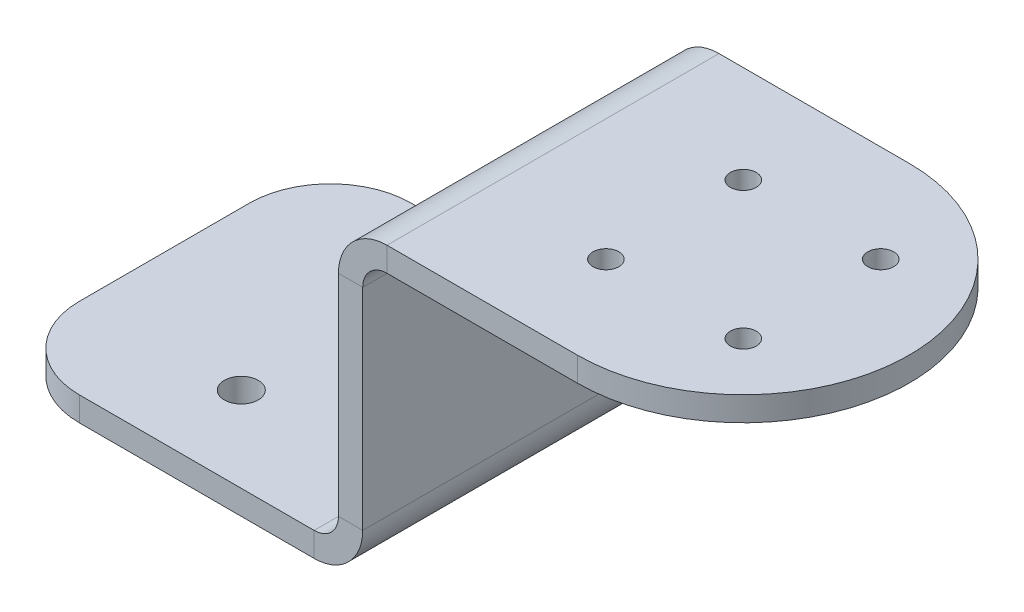
ISO-10303-21;
HEADER;
FILE_DESCRIPTION(('STEP AP214'),'2;1');
FILE_NAME('part.step','',(''),(''),'','','');
FILE_SCHEMA(('AUTOMOTIVE_DESIGN { 1 0 10303 214 1 1 1 1 }'));
ENDSEC;
DATA;
#1=APPLICATION_CONTEXT('core data for automotive mechanical design processes');
#2=APPLICATION_PROTOCOL_DEFINITION('international standard','automotive_design',2000,#1);
#3=PRODUCT_CONTEXT('',#1,'mechanical');
#4=PRODUCT('Part','Part','',(#3));
#5=PRODUCT_RELATED_PRODUCT_CATEGORY('part','',(#4));
#6=PRODUCT_DEFINITION_FORMATION('','',#4);
#7=PRODUCT_DEFINITION_CONTEXT('part definition',#1,'design');
#8=PRODUCT_DEFINITION('design','',#6,#7);
#9=PRODUCT_DEFINITION_SHAPE('','',#8);
#10=(LENGTH_UNIT() NAMED_UNIT(*) SI_UNIT(.MILLI.,.METRE.));
#11=(NAMED_UNIT(*) PLANE_ANGLE_UNIT() SI_UNIT($,.RADIAN.));
#12=(NAMED_UNIT(*) SI_UNIT($,.STERADIAN.) SOLID_ANGLE_UNIT());
#13=UNCERTAINTY_MEASURE_WITH_UNIT(LENGTH_MEASURE(1.E-05),#10,'distance_accuracy_value','');
#14=(GEOMETRIC_REPRESENTATION_CONTEXT(3) GLOBAL_UNCERTAINTY_ASSIGNED_CONTEXT((#13)) GLOBAL_UNIT_ASSIGNED_CONTEXT((#10,
#11,#12)) REPRESENTATION_CONTEXT('',''));
#15=CARTESIAN_POINT('',(0.,0.,0.));
#16=DIRECTION('',(0.,0.,1.));
#17=DIRECTION('',(1.,0.,0.));
#18=AXIS2_PLACEMENT_3D('',#15,#16,#17);
#19=CARTESIAN_POINT('',(0.,38.,41.));
#20=DIRECTION('',(0.,0.,1.));
#21=DIRECTION('',(1.,0.,0.));
#22=AXIS2_PLACEMENT_3D('',#19,#20,#21);
#23=PLANE('',#22);
#24=DIRECTION('',(1.,0.,0.));
#25=VECTOR('',#24,1.);
#26=CARTESIAN_POINT('',(0.,35.,41.));
#27=LINE('',#26,#25);
#28=CARTESIAN_POINT('',(3.,35.,41.));
#29=VERTEX_POINT('',#28);
#30=CARTESIAN_POINT('',(26.5,35.,41.));
#31=VERTEX_POINT('',#30);
#32=EDGE_CURVE('E171',#29,#31,#27,.T.);
#33=ORIENTED_EDGE('',*,*,#32,.T.);
#34=DIRECTION('',(0.,-1.,0.));
#35=VECTOR('',#34,1.);
#36=CARTESIAN_POINT('',(26.5,35.,41.));
#37=LINE('',#36,#35);
#38=CARTESIAN_POINT('',(26.5,38.,41.));
#39=VERTEX_POINT('',#38);
#40=EDGE_CURVE('E154',#31,#39,#37,.F.);
#41=ORIENTED_EDGE('',*,*,#40,.T.);
#42=DIRECTION('',(1.,0.,0.));
#43=VECTOR('',#42,1.);
#44=CARTESIAN_POINT('',(0.,38.,41.));
#45=LINE('',#44,#43);
#46=CARTESIAN_POINT('',(3.,38.,41.));
#47=VERTEX_POINT('',#46);
#48=EDGE_CURVE('E168',#47,#39,#45,.T.);
#49=ORIENTED_EDGE('',*,*,#48,.F.);
#50=DIRECTION('',(0.,1.,0.));
#51=VECTOR('',#50,1.);
#52=CARTESIAN_POINT('',(3.,38.,41.));
#53=LINE('',#52,#51);
#54=EDGE_CURVE('E295',#29,#47,#53,.T.);
#55=ORIENTED_EDGE('',*,*,#54,.F.);
#56=EDGE_LOOP('',(#33,#41,#49,#55));
#57=FACE_BOUND('',#56,.T.);
#58=ADVANCED_FACE('F49',(#57),#23,.T.);
#59=CARTESIAN_POINT('',(0.,38.,0.));
#60=DIRECTION('',(0.,0.,1.));
#61=DIRECTION('',(1.,0.,0.));
#62=AXIS2_PLACEMENT_3D('',#59,#60,#61);
#63=PLANE('',#62);
#64=DIRECTION('',(1.,0.,0.));
#65=VECTOR('',#64,1.);
#66=CARTESIAN_POINT('',(0.,38.,0.));
#67=LINE('',#66,#65);
#68=CARTESIAN_POINT('',(3.,38.,0.));
#69=VERTEX_POINT('',#68);
#70=CARTESIAN_POINT('',(26.5,38.,0.));
#71=VERTEX_POINT('',#70);
#72=EDGE_CURVE('E180',#69,#71,#67,.T.);
#73=ORIENTED_EDGE('',*,*,#72,.T.);
#74=DIRECTION('',(0.,-1.,0.));
#75=VECTOR('',#74,1.);
#76=CARTESIAN_POINT('',(26.5,35.,0.));
#77=LINE('',#76,#75);
#78=CARTESIAN_POINT('',(26.5,35.,0.));
#79=VERTEX_POINT('',#78);
#80=EDGE_CURVE('E157',#79,#71,#77,.F.);
#81=ORIENTED_EDGE('',*,*,#80,.F.);
#82=DIRECTION('',(1.,0.,0.));
#83=VECTOR('',#82,1.);
#84=CARTESIAN_POINT('',(0.,35.,0.));
#85=LINE('',#84,#83);
#86=CARTESIAN_POINT('',(3.,35.,0.));
#87=VERTEX_POINT('',#86);
#88=EDGE_CURVE('E267',#87,#79,#85,.T.);
#89=ORIENTED_EDGE('',*,*,#88,.F.);
#90=DIRECTION('',(0.,1.,0.));
#91=VECTOR('',#90,1.);
#92=CARTESIAN_POINT('',(3.,38.,0.));
#93=LINE('',#92,#91);
#94=EDGE_CURVE('E292',#87,#69,#93,.T.);
#95=ORIENTED_EDGE('',*,*,#94,.T.);
#96=EDGE_LOOP('',(#73,#81,#89,#95));
#97=FACE_BOUND('',#96,.T.);
#98=ADVANCED_FACE('F383',(#97),#63,.F.);
#99=CARTESIAN_POINT('',(0.,38.,41.));
#100=DIRECTION('',(0.,1.,0.));
#101=DIRECTION('',(0.,0.,1.));
#102=AXIS2_PLACEMENT_3D('',#99,#100,#101);
#103=PLANE('',#102);
#104=CARTESIAN_POINT('',(18.0147186257615,38.,12.0147186257614));
#105=DIRECTION('',(0.,1.,0.));
#106=DIRECTION('',(0.,0.,1.));
#107=AXIS2_PLACEMENT_3D('',#104,#105,#106);
#108=CIRCLE('',#107,1.6);
#109=CARTESIAN_POINT('',(18.0147186257615,38.,13.6147186257614));
#110=VERTEX_POINT('',#109);
#111=EDGE_CURVE('E403',#110,#110,#108,.F.);
#112=ORIENTED_EDGE('',*,*,#111,.T.);
#113=EDGE_LOOP('',(#112));
#114=FACE_BOUND('',#113,.T.);
#115=CARTESIAN_POINT('',(18.0147186257614,38.,28.9852813742386));
#116=DIRECTION('',(0.,1.,0.));
#117=DIRECTION('',(0.,0.,1.));
#118=AXIS2_PLACEMENT_3D('',#115,#116,#117);
#119=CIRCLE('',#118,1.6);
#120=CARTESIAN_POINT('',(18.0147186257614,38.,30.5852813742386));
#121=VERTEX_POINT('',#120);
#122=EDGE_CURVE('E426',#121,#121,#119,.F.);
#123=ORIENTED_EDGE('',*,*,#122,.T.);
#124=EDGE_LOOP('',(#123));
#125=FACE_BOUND('',#124,.T.);
#126=CARTESIAN_POINT('',(34.9852813742386,38.,28.9852813742386));
#127=DIRECTION('',(0.,1.,0.));
#128=DIRECTION('',(0.,0.,1.));
#129=AXIS2_PLACEMENT_3D('',#126,#127,#128);
#130=CIRCLE('',#129,1.59999999999997);
#131=CARTESIAN_POINT('',(34.9852813742386,38.,30.5852813742385));
#132=VERTEX_POINT('',#131);
#133=EDGE_CURVE('E418',#132,#132,#130,.F.);
#134=ORIENTED_EDGE('',*,*,#133,.T.);
#135=EDGE_LOOP('',(#134));
#136=FACE_BOUND('',#135,.T.);
#137=CARTESIAN_POINT('',(34.9852813742385,38.,12.0147186257614));
#138=DIRECTION('',(0.,1.,0.));
#139=DIRECTION('',(0.,0.,1.));
#140=AXIS2_PLACEMENT_3D('',#137,#138,#139);
#141=CIRCLE('',#140,1.60000000000003);
#142=CARTESIAN_POINT('',(34.9852813742385,38.,13.6147186257614));
#143=VERTEX_POINT('',#142);
#144=EDGE_CURVE('E409',#143,#143,#141,.F.);
#145=ORIENTED_EDGE('',*,*,#144,.T.);
#146=EDGE_LOOP('',(#145));
#147=FACE_BOUND('',#146,.T.);
#148=ORIENTED_EDGE('',*,*,#48,.T.);
#149=CARTESIAN_POINT('',(26.5,38.,20.5));
#150=DIRECTION('',(0.,1.,0.));
#151=DIRECTION('',(0.,0.,1.));
#152=AXIS2_PLACEMENT_3D('',#149,#150,#151);
#153=CIRCLE('',#152,20.5);
#154=EDGE_CURVE('E151',#39,#71,#153,.T.);
#155=ORIENTED_EDGE('',*,*,#154,.T.);
#156=ORIENTED_EDGE('',*,*,#72,.F.);
#157=DIRECTION('',(0.,0.,-1.));
#158=VECTOR('',#157,1.);
#159=CARTESIAN_POINT('',(3.,38.,41.));
#160=LINE('',#159,#158);
#161=EDGE_CURVE('E177',#69,#47,#160,.F.);
#162=ORIENTED_EDGE('',*,*,#161,.T.);
#163=EDGE_LOOP('',(#148,#155,#156,#162));
#164=FACE_BOUND('',#163,.T.);
#165=ADVANCED_FACE('F175',(#114,#125,#136,#147,#164),#103,.T.);
#166=CARTESIAN_POINT('',(0.,35.,41.));
#167=DIRECTION('',(0.,1.,0.));
#168=DIRECTION('',(0.,0.,1.));
#169=AXIS2_PLACEMENT_3D('',#166,#167,#168);
#170=PLANE('',#169);
#171=CARTESIAN_POINT('',(18.0147186257615,35.,12.0147186257614));
#172=DIRECTION('',(0.,1.,0.));
#173=DIRECTION('',(0.,0.,1.));
#174=AXIS2_PLACEMENT_3D('',#171,#172,#173);
#175=CIRCLE('',#174,1.6);
#176=CARTESIAN_POINT('',(18.0147186257615,35.,13.6147186257614));
#177=VERTEX_POINT('',#176);
#178=EDGE_CURVE('E430',#177,#177,#175,.F.);
#179=ORIENTED_EDGE('',*,*,#178,.F.);
#180=EDGE_LOOP('',(#179));
#181=FACE_BOUND('',#180,.T.);
#182=CARTESIAN_POINT('',(18.0147186257614,35.,28.9852813742386));
#183=DIRECTION('',(0.,1.,0.));
#184=DIRECTION('',(0.,0.,1.));
#185=AXIS2_PLACEMENT_3D('',#182,#183,#184);
#186=CIRCLE('',#185,1.6);
#187=CARTESIAN_POINT('',(18.0147186257614,35.,30.5852813742386));
#188=VERTEX_POINT('',#187);
#189=EDGE_CURVE('E422',#188,#188,#186,.F.);
#190=ORIENTED_EDGE('',*,*,#189,.F.);
#191=EDGE_LOOP('',(#190));
#192=FACE_BOUND('',#191,.T.);
#193=CARTESIAN_POINT('',(34.9852813742386,35.,28.9852813742386));
#194=DIRECTION('',(0.,1.,0.));
#195=DIRECTION('',(0.,0.,1.));
#196=AXIS2_PLACEMENT_3D('',#193,#194,#195);
#197=CIRCLE('',#196,1.59999999999997);
#198=CARTESIAN_POINT('',(34.9852813742386,35.,30.5852813742385));
#199=VERTEX_POINT('',#198);
#200=EDGE_CURVE('E414',#199,#199,#197,.F.);
#201=ORIENTED_EDGE('',*,*,#200,.F.);
#202=EDGE_LOOP('',(#201));
#203=FACE_BOUND('',#202,.T.);
#204=CARTESIAN_POINT('',(34.9852813742385,35.,12.0147186257614));
#205=DIRECTION('',(0.,1.,0.));
#206=DIRECTION('',(0.,0.,1.));
#207=AXIS2_PLACEMENT_3D('',#204,#205,#206);
#208=CIRCLE('',#207,1.60000000000003);
#209=CARTESIAN_POINT('',(34.9852813742385,35.,13.6147186257614));
#210=VERTEX_POINT('',#209);
#211=EDGE_CURVE('E405',#210,#210,#208,.F.);
#212=ORIENTED_EDGE('',*,*,#211,.F.);
#213=EDGE_LOOP('',(#212));
#214=FACE_BOUND('',#213,.T.);
#215=CARTESIAN_POINT('',(26.5,35.,20.5));
#216=DIRECTION('',(0.,1.,0.));
#217=DIRECTION('',(0.,0.,1.));
#218=AXIS2_PLACEMENT_3D('',#215,#216,#217);
#219=CIRCLE('',#218,20.5);
#220=EDGE_CURVE('E163',#31,#79,#219,.T.);
#221=ORIENTED_EDGE('',*,*,#220,.F.);
#222=ORIENTED_EDGE('',*,*,#32,.F.);
#223=DIRECTION('',(0.,0.,1.));
#224=VECTOR('',#223,1.);
#225=CARTESIAN_POINT('',(3.,35.,41.));
#226=LINE('',#225,#224);
#227=EDGE_CURVE('E233',#87,#29,#226,.T.);
#228=ORIENTED_EDGE('',*,*,#227,.F.);
#229=ORIENTED_EDGE('',*,*,#88,.T.);
#230=EDGE_LOOP('',(#221,#222,#228,#229));
#231=FACE_BOUND('',#230,.T.);
#232=ADVANCED_FACE('F385',(#181,#192,#203,#214,#231),#170,.F.);
#233=CARTESIAN_POINT('',(-3.,0.,41.));
#234=DIRECTION('',(0.,0.,1.));
#235=DIRECTION('',(0.,1.,0.));
#236=AXIS2_PLACEMENT_3D('',#233,#234,#235);
#237=PLANE('',#236);
#238=DIRECTION('',(-1.,0.,0.));
#239=VECTOR('',#238,1.);
#240=CARTESIAN_POINT('',(-3.,6.,41.));
#241=LINE('',#240,#239);
#242=CARTESIAN_POINT('',(0.,6.,41.));
#243=VERTEX_POINT('',#242);
#244=CARTESIAN_POINT('',(-3.,6.,41.));
#245=VERTEX_POINT('',#244);
#246=EDGE_CURVE('E301',#243,#245,#241,.T.);
#247=ORIENTED_EDGE('',*,*,#246,.F.);
#248=DIRECTION('',(0.,1.,0.));
#249=VECTOR('',#248,1.);
#250=CARTESIAN_POINT('',(0.,0.,41.));
#251=LINE('',#250,#249);
#252=CARTESIAN_POINT('',(0.,32.,41.));
#253=VERTEX_POINT('',#252);
#254=EDGE_CURVE('E261',#243,#253,#251,.T.);
#255=ORIENTED_EDGE('',*,*,#254,.T.);
#256=DIRECTION('',(-1.,0.,0.));
#257=VECTOR('',#256,1.);
#258=CARTESIAN_POINT('',(-3.,32.,41.));
#259=LINE('',#258,#257);
#260=CARTESIAN_POINT('',(-3.,32.,41.));
#261=VERTEX_POINT('',#260);
#262=EDGE_CURVE('E298',#253,#261,#259,.T.);
#263=ORIENTED_EDGE('',*,*,#262,.T.);
#264=DIRECTION('',(0.,1.,0.));
#265=VECTOR('',#264,1.);
#266=CARTESIAN_POINT('',(-3.,0.,41.));
#267=LINE('',#266,#265);
#268=EDGE_CURVE('E187',#245,#261,#267,.T.);
#269=ORIENTED_EDGE('',*,*,#268,.F.);
#270=EDGE_LOOP('',(#247,#255,#263,#269));
#271=FACE_BOUND('',#270,.T.);
#272=ADVANCED_FACE('F390',(#271),#237,.T.);
#273=CARTESIAN_POINT('',(3.,32.,41.));
#274=DIRECTION('',(0.,0.,-1.));
#275=DIRECTION('',(-1.,0.,0.));
#276=AXIS2_PLACEMENT_3D('',#273,#274,#275);
#277=PLANE('',#276);
#278=ORIENTED_EDGE('',*,*,#262,.F.);
#279=CARTESIAN_POINT('',(3.,32.,41.));
#280=DIRECTION('',(0.,0.,-1.));
#281=DIRECTION('',(-1.,0.,0.));
#282=AXIS2_PLACEMENT_3D('',#279,#280,#281);
#283=CIRCLE('',#282,3.);
#284=EDGE_CURVE('E262',#253,#29,#283,.T.);
#285=ORIENTED_EDGE('',*,*,#284,.T.);
#286=ORIENTED_EDGE('',*,*,#54,.T.);
#287=CARTESIAN_POINT('',(3.,32.,41.));
#288=DIRECTION('',(0.,0.,1.));
#289=DIRECTION('',(1.,0.,0.));
#290=AXIS2_PLACEMENT_3D('',#287,#288,#289);
#291=CIRCLE('',#290,6.);
#292=EDGE_CURVE('E207',#261,#47,#291,.F.);
#293=ORIENTED_EDGE('',*,*,#292,.F.);
#294=EDGE_LOOP('',(#278,#285,#286,#293));
#295=FACE_BOUND('',#294,.T.);
#296=ADVANCED_FACE('F387',(#295),#277,.F.);
#297=CARTESIAN_POINT('',(3.,32.,0.));
#298=DIRECTION('',(0.,0.,1.));
#299=DIRECTION('',(1.,0.,0.));
#300=AXIS2_PLACEMENT_3D('',#297,#298,#299);
#301=PLANE('',#300);
#302=ORIENTED_EDGE('',*,*,#94,.F.);
#303=CARTESIAN_POINT('',(3.,32.,0.));
#304=DIRECTION('',(0.,0.,-1.));
#305=DIRECTION('',(-1.,0.,0.));
#306=AXIS2_PLACEMENT_3D('',#303,#304,#305);
#307=CIRCLE('',#306,3.);
#308=CARTESIAN_POINT('',(0.,32.,0.));
#309=VERTEX_POINT('',#308);
#310=EDGE_CURVE('E263',#87,#309,#307,.F.);
#311=ORIENTED_EDGE('',*,*,#310,.T.);
#312=DIRECTION('',(-1.,0.,0.));
#313=VECTOR('',#312,1.);
#314=CARTESIAN_POINT('',(-3.,32.,0.));
#315=LINE('',#314,#313);
#316=CARTESIAN_POINT('',(-3.,32.,0.));
#317=VERTEX_POINT('',#316);
#318=EDGE_CURVE('E289',#309,#317,#315,.T.);
#319=ORIENTED_EDGE('',*,*,#318,.T.);
#320=CARTESIAN_POINT('',(3.,32.,0.));
#321=DIRECTION('',(0.,0.,-1.));
#322=DIRECTION('',(-1.,0.,0.));
#323=AXIS2_PLACEMENT_3D('',#320,#321,#322);
#324=CIRCLE('',#323,6.);
#325=EDGE_CURVE('E203',#69,#317,#324,.F.);
#326=ORIENTED_EDGE('',*,*,#325,.F.);
#327=EDGE_LOOP('',(#302,#311,#319,#326));
#328=FACE_BOUND('',#327,.T.);
#329=ADVANCED_FACE('F376',(#328),#301,.F.);
#330=CARTESIAN_POINT('',(-3.,0.,0.));
#331=DIRECTION('',(0.,0.,1.));
#332=DIRECTION('',(0.,1.,0.));
#333=AXIS2_PLACEMENT_3D('',#330,#331,#332);
#334=PLANE('',#333);
#335=ORIENTED_EDGE('',*,*,#318,.F.);
#336=DIRECTION('',(0.,1.,0.));
#337=VECTOR('',#336,1.);
#338=CARTESIAN_POINT('',(0.,0.,0.));
#339=LINE('',#338,#337);
#340=CARTESIAN_POINT('',(0.,6.,0.));
#341=VERTEX_POINT('',#340);
#342=EDGE_CURVE('E257',#341,#309,#339,.T.);
#343=ORIENTED_EDGE('',*,*,#342,.F.);
#344=DIRECTION('',(-1.,0.,0.));
#345=VECTOR('',#344,1.);
#346=CARTESIAN_POINT('',(-3.,6.,0.));
#347=LINE('',#346,#345);
#348=CARTESIAN_POINT('',(-3.,6.,0.));
#349=VERTEX_POINT('',#348);
#350=EDGE_CURVE('E286',#341,#349,#347,.T.);
#351=ORIENTED_EDGE('',*,*,#350,.T.);
#352=DIRECTION('',(0.,1.,0.));
#353=VECTOR('',#352,1.);
#354=CARTESIAN_POINT('',(-3.,0.,0.));
#355=LINE('',#354,#353);
#356=EDGE_CURVE('E212',#349,#317,#355,.T.);
#357=ORIENTED_EDGE('',*,*,#356,.T.);
#358=EDGE_LOOP('',(#335,#343,#351,#357));
#359=FACE_BOUND('',#358,.T.);
#360=ADVANCED_FACE('F367',(#359),#334,.F.);
#361=CARTESIAN_POINT('',(-6.,6.,0.));
#362=DIRECTION('',(0.,0.,-1.));
#363=DIRECTION('',(-1.,0.,0.));
#364=AXIS2_PLACEMENT_3D('',#361,#362,#363);
#365=PLANE('',#364);
#366=ORIENTED_EDGE('',*,*,#350,.F.);
#367=CARTESIAN_POINT('',(-6.,6.,0.));
#368=DIRECTION('',(0.,0.,1.));
#369=DIRECTION('',(1.,0.,0.));
#370=AXIS2_PLACEMENT_3D('',#367,#368,#369);
#371=CIRCLE('',#370,6.);
#372=CARTESIAN_POINT('',(-6.,0.,0.));
#373=VERTEX_POINT('',#372);
#374=EDGE_CURVE('E173',#341,#373,#371,.F.);
#375=ORIENTED_EDGE('',*,*,#374,.T.);
#376=DIRECTION('',(0.,1.,0.));
#377=VECTOR('',#376,1.);
#378=CARTESIAN_POINT('',(-6.,3.,0.));
#379=LINE('',#378,#377);
#380=CARTESIAN_POINT('',(-6.,3.,0.));
#381=VERTEX_POINT('',#380);
#382=EDGE_CURVE('E282',#373,#381,#379,.T.);
#383=ORIENTED_EDGE('',*,*,#382,.T.);
#384=CARTESIAN_POINT('',(-6.,6.,0.));
#385=DIRECTION('',(0.,0.,1.));
#386=DIRECTION('',(1.,0.,0.));
#387=AXIS2_PLACEMENT_3D('',#384,#385,#386);
#388=CIRCLE('',#387,3.);
#389=EDGE_CURVE('E221',#349,#381,#388,.F.);
#390=ORIENTED_EDGE('',*,*,#389,.F.);
#391=EDGE_LOOP('',(#366,#375,#383,#390));
#392=FACE_BOUND('',#391,.T.);
#393=ADVANCED_FACE('F358',(#392),#365,.T.);
#394=CARTESIAN_POINT('',(0.,3.,0.));
#395=DIRECTION('',(0.,0.,1.));
#396=DIRECTION('',(1.,0.,0.));
#397=AXIS2_PLACEMENT_3D('',#394,#395,#396);
#398=PLANE('',#397);
#399=DIRECTION('',(-1.,0.,0.));
#400=VECTOR('',#399,1.);
#401=CARTESIAN_POINT('',(0.,0.,0.));
#402=LINE('',#401,#400);
#403=CARTESIAN_POINT('',(-35.,0.,0.));
#404=VERTEX_POINT('',#403);
#405=EDGE_CURVE('E250',#404,#373,#402,.F.);
#406=ORIENTED_EDGE('',*,*,#405,.F.);
#407=DIRECTION('',(0.,-1.,0.));
#408=VECTOR('',#407,1.);
#409=CARTESIAN_POINT('',(-35.,3.,0.));
#410=LINE('',#409,#408);
#411=CARTESIAN_POINT('',(-35.,3.,0.));
#412=VERTEX_POINT('',#411);
#413=EDGE_CURVE('E304',#404,#412,#410,.F.);
#414=ORIENTED_EDGE('',*,*,#413,.T.);
#415=DIRECTION('',(1.,0.,0.));
#416=VECTOR('',#415,1.);
#417=CARTESIAN_POINT('',(0.,3.,0.));
#418=LINE('',#417,#416);
#419=EDGE_CURVE('E179',#412,#381,#418,.T.);
#420=ORIENTED_EDGE('',*,*,#419,.T.);
#421=ORIENTED_EDGE('',*,*,#382,.F.);
#422=EDGE_LOOP('',(#406,#414,#420,#421));
#423=FACE_BOUND('',#422,.T.);
#424=ADVANCED_FACE('F336',(#423),#398,.F.);
#425=CARTESIAN_POINT('',(-45.,2.99999999999999,41.));
#426=DIRECTION('',(1.,0.,0.));
#427=DIRECTION('',(0.,0.,-1.));
#428=AXIS2_PLACEMENT_3D('',#425,#426,#427);
#429=PLANE('',#428);
#430=DIRECTION('',(0.,0.,-1.));
#431=VECTOR('',#430,1.);
#432=CARTESIAN_POINT('',(-45.,2.99999999999999,41.));
#433=LINE('',#432,#431);
#434=CARTESIAN_POINT('',(-45.,2.99999999999999,31.));
#435=VERTEX_POINT('',#434);
#436=CARTESIAN_POINT('',(-45.,2.99999999999999,10.));
#437=VERTEX_POINT('',#436);
#438=EDGE_CURVE('E185',#435,#437,#433,.T.);
#439=ORIENTED_EDGE('',*,*,#438,.T.);
#440=DIRECTION('',(0.,-1.,0.));
#441=VECTOR('',#440,1.);
#442=CARTESIAN_POINT('',(-45.,2.99999999999999,10.));
#443=LINE('',#442,#441);
#444=CARTESIAN_POINT('',(-45.,0.,10.));
#445=VERTEX_POINT('',#444);
#446=EDGE_CURVE('E71',#437,#445,#443,.T.);
#447=ORIENTED_EDGE('',*,*,#446,.T.);
#448=DIRECTION('',(0.,0.,1.));
#449=VECTOR('',#448,1.);
#450=CARTESIAN_POINT('',(-45.,0.,41.));
#451=LINE('',#450,#449);
#452=CARTESIAN_POINT('',(-45.,0.,31.));
#453=VERTEX_POINT('',#452);
#454=EDGE_CURVE('E247',#453,#445,#451,.F.);
#455=ORIENTED_EDGE('',*,*,#454,.F.);
#456=DIRECTION('',(0.,1.,0.));
#457=VECTOR('',#456,1.);
#458=CARTESIAN_POINT('',(-45.,2.99999999999999,31.));
#459=LINE('',#458,#457);
#460=EDGE_CURVE('E317',#453,#435,#459,.T.);
#461=ORIENTED_EDGE('',*,*,#460,.T.);
#462=EDGE_LOOP('',(#439,#447,#455,#461));
#463=FACE_BOUND('',#462,.T.);
#464=ADVANCED_FACE('F342',(#463),#429,.F.);
#465=CARTESIAN_POINT('',(0.,3.,41.));
#466=DIRECTION('',(0.,0.,1.));
#467=DIRECTION('',(1.,0.,0.));
#468=AXIS2_PLACEMENT_3D('',#465,#466,#467);
#469=PLANE('',#468);
#470=DIRECTION('',(1.,0.,0.));
#471=VECTOR('',#470,1.);
#472=CARTESIAN_POINT('',(0.,3.,41.));
#473=LINE('',#472,#471);
#474=CARTESIAN_POINT('',(-35.,3.,41.));
#475=VERTEX_POINT('',#474);
#476=CARTESIAN_POINT('',(-6.,3.,41.));
#477=VERTEX_POINT('',#476);
#478=EDGE_CURVE('E193',#475,#477,#473,.T.);
#479=ORIENTED_EDGE('',*,*,#478,.F.);
#480=DIRECTION('',(0.,-1.,0.));
#481=VECTOR('',#480,1.);
#482=CARTESIAN_POINT('',(-35.,3.,41.));
#483=LINE('',#482,#481);
#484=CARTESIAN_POINT('',(-35.,0.,41.));
#485=VERTEX_POINT('',#484);
#486=EDGE_CURVE('E11',#475,#485,#483,.T.);
#487=ORIENTED_EDGE('',*,*,#486,.T.);
#488=DIRECTION('',(-1.,0.,0.));
#489=VECTOR('',#488,1.);
#490=CARTESIAN_POINT('',(0.,0.,41.));
#491=LINE('',#490,#489);
#492=CARTESIAN_POINT('',(-6.,0.,41.));
#493=VERTEX_POINT('',#492);
#494=EDGE_CURVE('E241',#485,#493,#491,.F.);
#495=ORIENTED_EDGE('',*,*,#494,.T.);
#496=DIRECTION('',(0.,1.,0.));
#497=VECTOR('',#496,1.);
#498=CARTESIAN_POINT('',(-6.,3.,41.));
#499=LINE('',#498,#497);
#500=EDGE_CURVE('E220',#493,#477,#499,.T.);
#501=ORIENTED_EDGE('',*,*,#500,.T.);
#502=EDGE_LOOP('',(#479,#487,#495,#501));
#503=FACE_BOUND('',#502,.T.);
#504=ADVANCED_FACE('F346',(#503),#469,.T.);
#505=CARTESIAN_POINT('',(-6.,6.,41.));
#506=DIRECTION('',(0.,0.,1.));
#507=DIRECTION('',(1.,0.,0.));
#508=AXIS2_PLACEMENT_3D('',#505,#506,#507);
#509=PLANE('',#508);
#510=CARTESIAN_POINT('',(-6.,6.,41.));
#511=DIRECTION('',(0.,0.,1.));
#512=DIRECTION('',(1.,0.,0.));
#513=AXIS2_PLACEMENT_3D('',#510,#511,#512);
#514=CIRCLE('',#513,6.);
#515=EDGE_CURVE('E256',#493,#243,#514,.T.);
#516=ORIENTED_EDGE('',*,*,#515,.T.);
#517=ORIENTED_EDGE('',*,*,#246,.T.);
#518=CARTESIAN_POINT('',(-6.,6.,41.));
#519=DIRECTION('',(0.,0.,-1.));
#520=DIRECTION('',(-1.,0.,0.));
#521=AXIS2_PLACEMENT_3D('',#518,#519,#520);
#522=CIRCLE('',#521,3.);
#523=EDGE_CURVE('E208',#477,#245,#522,.F.);
#524=ORIENTED_EDGE('',*,*,#523,.F.);
#525=ORIENTED_EDGE('',*,*,#500,.F.);
#526=EDGE_LOOP('',(#516,#517,#524,#525));
#527=FACE_BOUND('',#526,.T.);
#528=ADVANCED_FACE('F351',(#527),#509,.T.);
#529=CARTESIAN_POINT('',(0.,3.,41.));
#530=DIRECTION('',(0.,1.,0.));
#531=DIRECTION('',(-1.,0.,0.));
#532=AXIS2_PLACEMENT_3D('',#529,#530,#531);
#533=PLANE('',#532);
#534=CARTESIAN_POINT('',(-25.5,3.,10.5));
#535=DIRECTION('',(0.,1.,0.));
#536=DIRECTION('',(0.,0.,1.));
#537=AXIS2_PLACEMENT_3D('',#534,#535,#536);
#538=CIRCLE('',#537,2.09999999999999);
#539=CARTESIAN_POINT('',(-25.5,3.,12.6));
#540=VERTEX_POINT('',#539);
#541=EDGE_CURVE('E448',#540,#540,#538,.T.);
#542=ORIENTED_EDGE('',*,*,#541,.F.);
#543=EDGE_LOOP('',(#542));
#544=FACE_BOUND('',#543,.T.);
#545=CARTESIAN_POINT('',(-25.5,3.,30.5));
#546=DIRECTION('',(0.,1.,0.));
#547=DIRECTION('',(0.,0.,1.));
#548=AXIS2_PLACEMENT_3D('',#545,#546,#547);
#549=CIRCLE('',#548,2.09999999999999);
#550=CARTESIAN_POINT('',(-25.5,3.,32.6));
#551=VERTEX_POINT('',#550);
#552=EDGE_CURVE('E440',#551,#551,#549,.T.);
#553=ORIENTED_EDGE('',*,*,#552,.F.);
#554=EDGE_LOOP('',(#553));
#555=FACE_BOUND('',#554,.T.);
#556=ORIENTED_EDGE('',*,*,#419,.F.);
#557=CARTESIAN_POINT('',(-35.,3.,10.));
#558=DIRECTION('',(0.,1.,0.));
#559=DIRECTION('',(-1.,0.,0.));
#560=AXIS2_PLACEMENT_3D('',#557,#558,#559);
#561=CIRCLE('',#560,10.);
#562=EDGE_CURVE('E314',#412,#437,#561,.T.);
#563=ORIENTED_EDGE('',*,*,#562,.T.);
#564=ORIENTED_EDGE('',*,*,#438,.F.);
#565=CARTESIAN_POINT('',(-35.,3.,31.));
#566=DIRECTION('',(0.,1.,0.));
#567=DIRECTION('',(-1.,0.,0.));
#568=AXIS2_PLACEMENT_3D('',#565,#566,#567);
#569=CIRCLE('',#568,10.);
#570=EDGE_CURVE('E311',#435,#475,#569,.T.);
#571=ORIENTED_EDGE('',*,*,#570,.T.);
#572=ORIENTED_EDGE('',*,*,#478,.T.);
#573=DIRECTION('',(0.,0.,-1.));
#574=VECTOR('',#573,1.);
#575=CARTESIAN_POINT('',(-6.,3.,0.));
#576=LINE('',#575,#574);
#577=EDGE_CURVE('E202',#477,#381,#576,.T.);
#578=ORIENTED_EDGE('',*,*,#577,.T.);
#579=EDGE_LOOP('',(#556,#563,#564,#571,#572,#578));
#580=FACE_BOUND('',#579,.T.);
#581=ADVANCED_FACE('F341',(#544,#555,#580),#533,.T.);
#582=CARTESIAN_POINT('',(-3.,0.,41.));
#583=DIRECTION('',(-1.,0.,0.));
#584=DIRECTION('',(0.,0.,1.));
#585=AXIS2_PLACEMENT_3D('',#582,#583,#584);
#586=PLANE('',#585);
#587=ORIENTED_EDGE('',*,*,#356,.F.);
#588=DIRECTION('',(0.,0.,-1.));
#589=VECTOR('',#588,1.);
#590=CARTESIAN_POINT('',(-3.,6.,41.));
#591=LINE('',#590,#589);
#592=EDGE_CURVE('E216',#349,#245,#591,.F.);
#593=ORIENTED_EDGE('',*,*,#592,.T.);
#594=ORIENTED_EDGE('',*,*,#268,.T.);
#595=DIRECTION('',(0.,0.,-1.));
#596=VECTOR('',#595,1.);
#597=CARTESIAN_POINT('',(-3.,32.,41.));
#598=LINE('',#597,#596);
#599=EDGE_CURVE('E196',#261,#317,#598,.T.);
#600=ORIENTED_EDGE('',*,*,#599,.T.);
#601=EDGE_LOOP('',(#587,#593,#594,#600));
#602=FACE_BOUND('',#601,.T.);
#603=ADVANCED_FACE('F394',(#602),#586,.T.);
#604=CARTESIAN_POINT('',(3.,32.,41.));
#605=DIRECTION('',(0.,0.,-1.));
#606=DIRECTION('',(-1.,0.,0.));
#607=AXIS2_PLACEMENT_3D('',#604,#605,#606);
#608=CYLINDRICAL_SURFACE('',#607,6.);
#609=ORIENTED_EDGE('',*,*,#292,.T.);
#610=ORIENTED_EDGE('',*,*,#161,.F.);
#611=ORIENTED_EDGE('',*,*,#325,.T.);
#612=ORIENTED_EDGE('',*,*,#599,.F.);
#613=EDGE_LOOP('',(#609,#610,#611,#612));
#614=FACE_BOUND('',#613,.T.);
#615=ADVANCED_FACE('F598',(#614),#608,.T.);
#616=CARTESIAN_POINT('',(-6.,6.,41.));
#617=DIRECTION('',(0.,0.,1.));
#618=DIRECTION('',(1.,0.,0.));
#619=AXIS2_PLACEMENT_3D('',#616,#617,#618);
#620=CYLINDRICAL_SURFACE('',#619,3.);
#621=ORIENTED_EDGE('',*,*,#523,.T.);
#622=ORIENTED_EDGE('',*,*,#592,.F.);
#623=ORIENTED_EDGE('',*,*,#389,.T.);
#624=ORIENTED_EDGE('',*,*,#577,.F.);
#625=EDGE_LOOP('',(#621,#622,#623,#624));
#626=FACE_BOUND('',#625,.T.);
#627=ADVANCED_FACE('F355',(#626),#620,.F.);
#628=CARTESIAN_POINT('',(0.,0.,41.));
#629=DIRECTION('',(0.,1.,0.));
#630=DIRECTION('',(-1.,0.,0.));
#631=AXIS2_PLACEMENT_3D('',#628,#629,#630);
#632=PLANE('',#631);
#633=CARTESIAN_POINT('',(-25.5,0.,10.5));
#634=DIRECTION('',(0.,1.,0.));
#635=DIRECTION('',(0.,0.,1.));
#636=AXIS2_PLACEMENT_3D('',#633,#634,#635);
#637=CIRCLE('',#636,2.09999999999999);
#638=CARTESIAN_POINT('',(-25.5,0.,12.6));
#639=VERTEX_POINT('',#638);
#640=EDGE_CURVE('E444',#639,#639,#637,.T.);
#641=ORIENTED_EDGE('',*,*,#640,.T.);
#642=EDGE_LOOP('',(#641));
#643=FACE_BOUND('',#642,.T.);
#644=CARTESIAN_POINT('',(-25.5,0.,30.5));
#645=DIRECTION('',(0.,1.,0.));
#646=DIRECTION('',(0.,0.,1.));
#647=AXIS2_PLACEMENT_3D('',#644,#645,#646);
#648=CIRCLE('',#647,2.09999999999999);
#649=CARTESIAN_POINT('',(-25.5,0.,32.6));
#650=VERTEX_POINT('',#649);
#651=EDGE_CURVE('E410',#650,#650,#648,.T.);
#652=ORIENTED_EDGE('',*,*,#651,.T.);
#653=EDGE_LOOP('',(#652));
#654=FACE_BOUND('',#653,.T.);
#655=ORIENTED_EDGE('',*,*,#454,.T.);
#656=CARTESIAN_POINT('',(-35.,0.,10.));
#657=DIRECTION('',(0.,1.,0.));
#658=DIRECTION('',(-1.,0.,0.));
#659=AXIS2_PLACEMENT_3D('',#656,#657,#658);
#660=CIRCLE('',#659,10.);
#661=EDGE_CURVE('E58',#445,#404,#660,.F.);
#662=ORIENTED_EDGE('',*,*,#661,.T.);
#663=ORIENTED_EDGE('',*,*,#405,.T.);
#664=DIRECTION('',(0.,0.,1.));
#665=VECTOR('',#664,1.);
#666=CARTESIAN_POINT('',(-6.,0.,41.));
#667=LINE('',#666,#665);
#668=EDGE_CURVE('E229',#493,#373,#667,.F.);
#669=ORIENTED_EDGE('',*,*,#668,.F.);
#670=ORIENTED_EDGE('',*,*,#494,.F.);
#671=CARTESIAN_POINT('',(-35.,0.,31.));
#672=DIRECTION('',(0.,1.,0.));
#673=DIRECTION('',(-1.,0.,0.));
#674=AXIS2_PLACEMENT_3D('',#671,#672,#673);
#675=CIRCLE('',#674,10.);
#676=EDGE_CURVE('E323',#485,#453,#675,.F.);
#677=ORIENTED_EDGE('',*,*,#676,.T.);
#678=EDGE_LOOP('',(#655,#662,#663,#669,#670,#677));
#679=FACE_BOUND('',#678,.T.);
#680=ADVANCED_FACE('F330',(#643,#654,#679),#632,.F.);
#681=CARTESIAN_POINT('',(0.,0.,41.));
#682=DIRECTION('',(-1.,0.,0.));
#683=DIRECTION('',(0.,0.,1.));
#684=AXIS2_PLACEMENT_3D('',#681,#682,#683);
#685=PLANE('',#684);
#686=ORIENTED_EDGE('',*,*,#342,.T.);
#687=DIRECTION('',(0.,0.,1.));
#688=VECTOR('',#687,1.);
#689=CARTESIAN_POINT('',(0.,32.,41.));
#690=LINE('',#689,#688);
#691=EDGE_CURVE('E237',#253,#309,#690,.F.);
#692=ORIENTED_EDGE('',*,*,#691,.F.);
#693=ORIENTED_EDGE('',*,*,#254,.F.);
#694=DIRECTION('',(0.,0.,1.));
#695=VECTOR('',#694,1.);
#696=CARTESIAN_POINT('',(0.,6.,41.));
#697=LINE('',#696,#695);
#698=EDGE_CURVE('E225',#341,#243,#697,.T.);
#699=ORIENTED_EDGE('',*,*,#698,.F.);
#700=EDGE_LOOP('',(#686,#692,#693,#699));
#701=FACE_BOUND('',#700,.T.);
#702=ADVANCED_FACE('F372',(#701),#685,.F.);
#703=CARTESIAN_POINT('',(3.,32.,41.));
#704=DIRECTION('',(0.,0.,-1.));
#705=DIRECTION('',(-1.,0.,0.));
#706=AXIS2_PLACEMENT_3D('',#703,#704,#705);
#707=CYLINDRICAL_SURFACE('',#706,3.);
#708=ORIENTED_EDGE('',*,*,#284,.F.);
#709=ORIENTED_EDGE('',*,*,#691,.T.);
#710=ORIENTED_EDGE('',*,*,#310,.F.);
#711=ORIENTED_EDGE('',*,*,#227,.T.);
#712=EDGE_LOOP('',(#708,#709,#710,#711));
#713=FACE_BOUND('',#712,.T.);
#714=ADVANCED_FACE('F381',(#713),#707,.F.);
#715=CARTESIAN_POINT('',(-6.,6.,41.));
#716=DIRECTION('',(0.,0.,1.));
#717=DIRECTION('',(1.,0.,0.));
#718=AXIS2_PLACEMENT_3D('',#715,#716,#717);
#719=CYLINDRICAL_SURFACE('',#718,6.);
#720=ORIENTED_EDGE('',*,*,#515,.F.);
#721=ORIENTED_EDGE('',*,*,#668,.T.);
#722=ORIENTED_EDGE('',*,*,#374,.F.);
#723=ORIENTED_EDGE('',*,*,#698,.T.);
#724=EDGE_LOOP('',(#720,#721,#722,#723));
#725=FACE_BOUND('',#724,.T.);
#726=ADVANCED_FACE('F364',(#725),#719,.T.);
#727=CARTESIAN_POINT('',(26.5,35.,20.5));
#728=DIRECTION('',(0.,1.,0.));
#729=DIRECTION('',(0.,0.,1.));
#730=AXIS2_PLACEMENT_3D('',#727,#728,#729);
#731=CYLINDRICAL_SURFACE('',#730,20.5);
#732=ORIENTED_EDGE('',*,*,#40,.F.);
#733=ORIENTED_EDGE('',*,*,#220,.T.);
#734=ORIENTED_EDGE('',*,*,#80,.T.);
#735=ORIENTED_EDGE('',*,*,#154,.F.);
#736=EDGE_LOOP('',(#732,#733,#734,#735));
#737=FACE_BOUND('',#736,.T.);
#738=ADVANCED_FACE('F153',(#737),#731,.T.);
#739=CARTESIAN_POINT('',(34.9852813742385,35.,12.0147186257614));
#740=DIRECTION('',(0.,1.,0.));
#741=DIRECTION('',(0.,0.,1.));
#742=AXIS2_PLACEMENT_3D('',#739,#740,#741);
#743=CYLINDRICAL_SURFACE('',#742,1.60000000000003);
#744=ORIENTED_EDGE('',*,*,#144,.F.);
#745=EDGE_LOOP('',(#744));
#746=FACE_BOUND('',#745,.T.);
#747=ORIENTED_EDGE('',*,*,#211,.T.);
#748=EDGE_LOOP('',(#747));
#749=FACE_BOUND('',#748,.T.);
#750=ADVANCED_FACE('F536',(#746,#749),#743,.F.);
#751=CARTESIAN_POINT('',(34.9852813742386,35.,28.9852813742386));
#752=DIRECTION('',(0.,1.,0.));
#753=DIRECTION('',(0.,0.,1.));
#754=AXIS2_PLACEMENT_3D('',#751,#752,#753);
#755=CYLINDRICAL_SURFACE('',#754,1.59999999999997);
#756=ORIENTED_EDGE('',*,*,#133,.F.);
#757=EDGE_LOOP('',(#756));
#758=FACE_BOUND('',#757,.T.);
#759=ORIENTED_EDGE('',*,*,#200,.T.);
#760=EDGE_LOOP('',(#759));
#761=FACE_BOUND('',#760,.T.);
#762=ADVANCED_FACE('F526',(#758,#761),#755,.F.);
#763=CARTESIAN_POINT('',(18.0147186257614,35.,28.9852813742386));
#764=DIRECTION('',(0.,1.,0.));
#765=DIRECTION('',(0.,0.,1.));
#766=AXIS2_PLACEMENT_3D('',#763,#764,#765);
#767=CYLINDRICAL_SURFACE('',#766,1.6);
#768=ORIENTED_EDGE('',*,*,#122,.F.);
#769=EDGE_LOOP('',(#768));
#770=FACE_BOUND('',#769,.T.);
#771=ORIENTED_EDGE('',*,*,#189,.T.);
#772=EDGE_LOOP('',(#771));
#773=FACE_BOUND('',#772,.T.);
#774=ADVANCED_FACE('F472',(#770,#773),#767,.F.);
#775=CARTESIAN_POINT('',(18.0147186257615,35.,12.0147186257614));
#776=DIRECTION('',(0.,1.,0.));
#777=DIRECTION('',(0.,0.,1.));
#778=AXIS2_PLACEMENT_3D('',#775,#776,#777);
#779=CYLINDRICAL_SURFACE('',#778,1.6);
#780=ORIENTED_EDGE('',*,*,#111,.F.);
#781=EDGE_LOOP('',(#780));
#782=FACE_BOUND('',#781,.T.);
#783=ORIENTED_EDGE('',*,*,#178,.T.);
#784=EDGE_LOOP('',(#783));
#785=FACE_BOUND('',#784,.T.);
#786=ADVANCED_FACE('F463',(#782,#785),#779,.F.);
#787=CARTESIAN_POINT('',(-25.5,3.,30.5));
#788=DIRECTION('',(0.,1.,0.));
#789=DIRECTION('',(0.,0.,1.));
#790=AXIS2_PLACEMENT_3D('',#787,#788,#789);
#791=CYLINDRICAL_SURFACE('',#790,2.09999999999999);
#792=ORIENTED_EDGE('',*,*,#651,.F.);
#793=EDGE_LOOP('',(#792));
#794=FACE_BOUND('',#793,.T.);
#795=ORIENTED_EDGE('',*,*,#552,.T.);
#796=EDGE_LOOP('',(#795));
#797=FACE_BOUND('',#796,.T.);
#798=ADVANCED_FACE('F461',(#794,#797),#791,.F.);
#799=CARTESIAN_POINT('',(-25.5,3.,10.5));
#800=DIRECTION('',(0.,1.,0.));
#801=DIRECTION('',(0.,0.,1.));
#802=AXIS2_PLACEMENT_3D('',#799,#800,#801);
#803=CYLINDRICAL_SURFACE('',#802,2.09999999999999);
#804=ORIENTED_EDGE('',*,*,#640,.F.);
#805=EDGE_LOOP('',(#804));
#806=FACE_BOUND('',#805,.T.);
#807=ORIENTED_EDGE('',*,*,#541,.T.);
#808=EDGE_LOOP('',(#807));
#809=FACE_BOUND('',#808,.T.);
#810=ADVANCED_FACE('F454',(#806,#809),#803,.F.);
#811=CARTESIAN_POINT('',(-35.,3.,10.));
#812=DIRECTION('',(0.,1.,0.));
#813=DIRECTION('',(-1.,0.,0.));
#814=AXIS2_PLACEMENT_3D('',#811,#812,#813);
#815=CYLINDRICAL_SURFACE('',#814,10.);
#816=ORIENTED_EDGE('',*,*,#661,.F.);
#817=ORIENTED_EDGE('',*,*,#446,.F.);
#818=ORIENTED_EDGE('',*,*,#562,.F.);
#819=ORIENTED_EDGE('',*,*,#413,.F.);
#820=EDGE_LOOP('',(#816,#817,#818,#819));
#821=FACE_BOUND('',#820,.T.);
#822=ADVANCED_FACE('F338',(#821),#815,.T.);
#823=CARTESIAN_POINT('',(-35.,3.,31.));
#824=DIRECTION('',(0.,-1.,0.));
#825=DIRECTION('',(1.,0.,0.));
#826=AXIS2_PLACEMENT_3D('',#823,#824,#825);
#827=CYLINDRICAL_SURFACE('',#826,10.);
#828=ORIENTED_EDGE('',*,*,#676,.F.);
#829=ORIENTED_EDGE('',*,*,#486,.F.);
#830=ORIENTED_EDGE('',*,*,#570,.F.);
#831=ORIENTED_EDGE('',*,*,#460,.F.);
#832=EDGE_LOOP('',(#828,#829,#830,#831));
#833=FACE_BOUND('',#832,.T.);
#834=ADVANCED_FACE('F51',(#833),#827,.T.);
#835=CLOSED_SHELL('',(#58,#98,#165,#232,#272,#296,#329,#360,#393,#424,#464,#504,#528,#581,#603,
#615,#627,#680,#702,#714,#726,#738,#750,#762,#774,#786,#798,#810,#822,#834));
#836=MANIFOLD_SOLID_BREP('B2',#835);
#837=ADVANCED_BREP_SHAPE_REPRESENTATION('',(#18,#836),#14);
#838=SHAPE_DEFINITION_REPRESENTATION(#9,#837);
ENDSEC;
END-ISO-10303-21;
